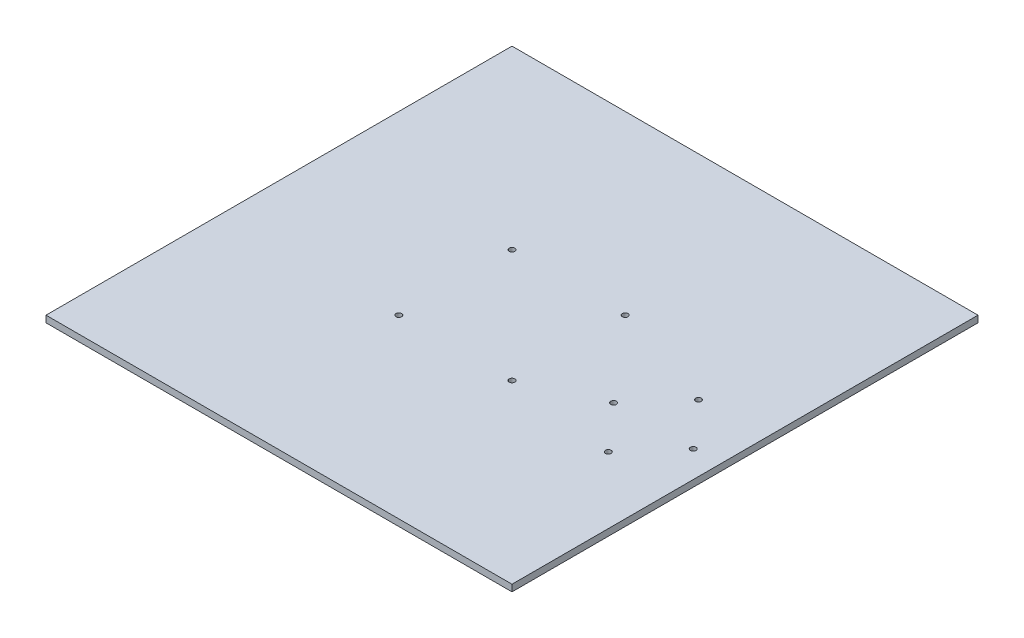
ISO-10303-21;
HEADER;
FILE_DESCRIPTION(('STEP AP214'),'2;1');
FILE_NAME('part.step','',(''),(''),'','','');
FILE_SCHEMA(('AUTOMOTIVE_DESIGN { 1 0 10303 214 1 1 1 1 }'));
ENDSEC;
DATA;
#1=APPLICATION_CONTEXT('core data for automotive mechanical design processes');
#2=APPLICATION_PROTOCOL_DEFINITION('international standard','automotive_design',2000,#1);
#3=PRODUCT_CONTEXT('',#1,'mechanical');
#4=PRODUCT('Part','Part','',(#3));
#5=PRODUCT_RELATED_PRODUCT_CATEGORY('part','',(#4));
#6=PRODUCT_DEFINITION_FORMATION('','',#4);
#7=PRODUCT_DEFINITION_CONTEXT('part definition',#1,'design');
#8=PRODUCT_DEFINITION('design','',#6,#7);
#9=PRODUCT_DEFINITION_SHAPE('','',#8);
#10=(LENGTH_UNIT() NAMED_UNIT(*) SI_UNIT(.MILLI.,.METRE.));
#11=(NAMED_UNIT(*) PLANE_ANGLE_UNIT() SI_UNIT($,.RADIAN.));
#12=(NAMED_UNIT(*) SI_UNIT($,.STERADIAN.) SOLID_ANGLE_UNIT());
#13=UNCERTAINTY_MEASURE_WITH_UNIT(LENGTH_MEASURE(1.E-05),#10,'distance_accuracy_value','');
#14=(GEOMETRIC_REPRESENTATION_CONTEXT(3) GLOBAL_UNCERTAINTY_ASSIGNED_CONTEXT((#13)) GLOBAL_UNIT_ASSIGNED_CONTEXT((#10,
#11,#12)) REPRESENTATION_CONTEXT('',''));
#15=CARTESIAN_POINT('',(0.,0.,0.));
#16=DIRECTION('',(0.,0.,1.));
#17=DIRECTION('',(1.,0.,0.));
#18=AXIS2_PLACEMENT_3D('',#15,#16,#17);
#19=CARTESIAN_POINT('',(-111.125,3.175,111.125));
#20=DIRECTION('',(1.,0.,0.));
#21=DIRECTION('',(0.,0.,-1.));
#22=AXIS2_PLACEMENT_3D('',#19,#20,#21);
#23=PLANE('',#22);
#24=DIRECTION('',(0.,0.,1.));
#25=VECTOR('',#24,1.);
#26=CARTESIAN_POINT('',(-111.125,0.,111.125));
#27=LINE('',#26,#25);
#28=CARTESIAN_POINT('',(-111.125,0.,-111.125));
#29=VERTEX_POINT('',#28);
#30=CARTESIAN_POINT('',(-111.125,0.,111.125));
#31=VERTEX_POINT('',#30);
#32=EDGE_CURVE('E100',#29,#31,#27,.T.);
#33=ORIENTED_EDGE('',*,*,#32,.T.);
#34=DIRECTION('',(0.,-1.,0.));
#35=VECTOR('',#34,1.);
#36=CARTESIAN_POINT('',(-111.125,3.175,111.125));
#37=LINE('',#36,#35);
#38=CARTESIAN_POINT('',(-111.125,3.175,111.125));
#39=VERTEX_POINT('',#38);
#40=EDGE_CURVE('E11',#39,#31,#37,.T.);
#41=ORIENTED_EDGE('',*,*,#40,.F.);
#42=DIRECTION('',(0.,0.,1.));
#43=VECTOR('',#42,1.);
#44=CARTESIAN_POINT('',(-111.125,3.175,111.125));
#45=LINE('',#44,#43);
#46=CARTESIAN_POINT('',(-111.125,3.175,-111.125));
#47=VERTEX_POINT('',#46);
#48=EDGE_CURVE('E88',#47,#39,#45,.T.);
#49=ORIENTED_EDGE('',*,*,#48,.F.);
#50=DIRECTION('',(0.,-1.,0.));
#51=VECTOR('',#50,1.);
#52=CARTESIAN_POINT('',(-111.125,3.175,-111.125));
#53=LINE('',#52,#51);
#54=EDGE_CURVE('E96',#47,#29,#53,.T.);
#55=ORIENTED_EDGE('',*,*,#54,.T.);
#56=EDGE_LOOP('',(#33,#41,#49,#55));
#57=FACE_BOUND('',#56,.T.);
#58=ADVANCED_FACE('F37',(#57),#23,.F.);
#59=CARTESIAN_POINT('',(-111.125,3.175,111.125));
#60=DIRECTION('',(0.,0.,-1.));
#61=DIRECTION('',(-1.,0.,0.));
#62=AXIS2_PLACEMENT_3D('',#59,#60,#61);
#63=PLANE('',#62);
#64=DIRECTION('',(1.,0.,0.));
#65=VECTOR('',#64,1.);
#66=CARTESIAN_POINT('',(-111.125,0.,111.125));
#67=LINE('',#66,#65);
#68=CARTESIAN_POINT('',(111.125,0.,111.125));
#69=VERTEX_POINT('',#68);
#70=EDGE_CURVE('E92',#31,#69,#67,.T.);
#71=ORIENTED_EDGE('',*,*,#70,.T.);
#72=DIRECTION('',(0.,-1.,0.));
#73=VECTOR('',#72,1.);
#74=CARTESIAN_POINT('',(111.125,3.175,111.125));
#75=LINE('',#74,#73);
#76=CARTESIAN_POINT('',(111.125,3.175,111.125));
#77=VERTEX_POINT('',#76);
#78=EDGE_CURVE('E45',#77,#69,#75,.T.);
#79=ORIENTED_EDGE('',*,*,#78,.F.);
#80=DIRECTION('',(1.,0.,0.));
#81=VECTOR('',#80,1.);
#82=CARTESIAN_POINT('',(-111.125,3.175,111.125));
#83=LINE('',#82,#81);
#84=EDGE_CURVE('E83',#39,#77,#83,.T.);
#85=ORIENTED_EDGE('',*,*,#84,.F.);
#86=ORIENTED_EDGE('',*,*,#40,.T.);
#87=EDGE_LOOP('',(#71,#79,#85,#86));
#88=FACE_BOUND('',#87,.T.);
#89=ADVANCED_FACE('F91',(#88),#63,.F.);
#90=CARTESIAN_POINT('',(111.125,3.175,111.125));
#91=DIRECTION('',(-1.,0.,0.));
#92=DIRECTION('',(0.,0.,1.));
#93=AXIS2_PLACEMENT_3D('',#90,#91,#92);
#94=PLANE('',#93);
#95=DIRECTION('',(0.,0.,-1.));
#96=VECTOR('',#95,1.);
#97=CARTESIAN_POINT('',(111.125,0.,111.125));
#98=LINE('',#97,#96);
#99=CARTESIAN_POINT('',(111.125,0.,-111.125));
#100=VERTEX_POINT('',#99);
#101=EDGE_CURVE('E70',#69,#100,#98,.T.);
#102=ORIENTED_EDGE('',*,*,#101,.T.);
#103=DIRECTION('',(0.,-1.,0.));
#104=VECTOR('',#103,1.);
#105=CARTESIAN_POINT('',(111.125,3.175,-111.125));
#106=LINE('',#105,#104);
#107=CARTESIAN_POINT('',(111.125,3.175,-111.125));
#108=VERTEX_POINT('',#107);
#109=EDGE_CURVE('E93',#108,#100,#106,.T.);
#110=ORIENTED_EDGE('',*,*,#109,.F.);
#111=DIRECTION('',(0.,0.,-1.));
#112=VECTOR('',#111,1.);
#113=CARTESIAN_POINT('',(111.125,3.175,111.125));
#114=LINE('',#113,#112);
#115=EDGE_CURVE('E86',#77,#108,#114,.T.);
#116=ORIENTED_EDGE('',*,*,#115,.F.);
#117=ORIENTED_EDGE('',*,*,#78,.T.);
#118=EDGE_LOOP('',(#102,#110,#116,#117));
#119=FACE_BOUND('',#118,.T.);
#120=ADVANCED_FACE('F94',(#119),#94,.F.);
#121=CARTESIAN_POINT('',(-111.125,3.175,-111.125));
#122=DIRECTION('',(0.,0.,1.));
#123=DIRECTION('',(1.,0.,0.));
#124=AXIS2_PLACEMENT_3D('',#121,#122,#123);
#125=PLANE('',#124);
#126=DIRECTION('',(-1.,0.,0.));
#127=VECTOR('',#126,1.);
#128=CARTESIAN_POINT('',(-111.125,0.,-111.125));
#129=LINE('',#128,#127);
#130=EDGE_CURVE('E76',#100,#29,#129,.T.);
#131=ORIENTED_EDGE('',*,*,#130,.T.);
#132=ORIENTED_EDGE('',*,*,#54,.F.);
#133=DIRECTION('',(-1.,0.,0.));
#134=VECTOR('',#133,1.);
#135=CARTESIAN_POINT('',(-111.125,3.175,-111.125));
#136=LINE('',#135,#134);
#137=EDGE_CURVE('E53',#108,#47,#136,.T.);
#138=ORIENTED_EDGE('',*,*,#137,.F.);
#139=ORIENTED_EDGE('',*,*,#109,.T.);
#140=EDGE_LOOP('',(#131,#132,#138,#139));
#141=FACE_BOUND('',#140,.T.);
#142=ADVANCED_FACE('F108',(#141),#125,.F.);
#143=CARTESIAN_POINT('',(0.,3.175,0.));
#144=DIRECTION('',(0.,-1.,0.));
#145=DIRECTION('',(0.,0.,-1.));
#146=AXIS2_PLACEMENT_3D('',#143,#144,#145);
#147=PLANE('',#146);
#148=CARTESIAN_POINT('',(60.425,3.175,12.));
#149=DIRECTION('',(0.,1.,0.));
#150=DIRECTION('',(0.,0.,1.));
#151=AXIS2_PLACEMENT_3D('',#148,#149,#150);
#152=CIRCLE('',#151,1.35254999999999);
#153=CARTESIAN_POINT('',(60.425,3.175,13.35255));
#154=VERTEX_POINT('',#153);
#155=EDGE_CURVE('E158',#154,#154,#152,.T.);
#156=ORIENTED_EDGE('',*,*,#155,.F.);
#157=EDGE_LOOP('',(#156));
#158=FACE_BOUND('',#157,.T.);
#159=CARTESIAN_POINT('',(79.425,3.175,33.5));
#160=DIRECTION('',(0.,1.,0.));
#161=DIRECTION('',(0.,0.,1.));
#162=AXIS2_PLACEMENT_3D('',#159,#160,#161);
#163=CIRCLE('',#162,1.35254999999998);
#164=CARTESIAN_POINT('',(79.425,3.175,34.85255));
#165=VERTEX_POINT('',#164);
#166=EDGE_CURVE('E152',#165,#165,#163,.T.);
#167=ORIENTED_EDGE('',*,*,#166,.F.);
#168=EDGE_LOOP('',(#167));
#169=FACE_BOUND('',#168,.T.);
#170=CARTESIAN_POINT('',(98.425,3.175,12.));
#171=DIRECTION('',(0.,1.,0.));
#172=DIRECTION('',(0.,0.,1.));
#173=AXIS2_PLACEMENT_3D('',#170,#171,#172);
#174=CIRCLE('',#173,1.35254999999999);
#175=CARTESIAN_POINT('',(98.425,3.175,13.35255));
#176=VERTEX_POINT('',#175);
#177=EDGE_CURVE('E146',#176,#176,#174,.T.);
#178=ORIENTED_EDGE('',*,*,#177,.F.);
#179=EDGE_LOOP('',(#178));
#180=FACE_BOUND('',#179,.T.);
#181=CARTESIAN_POINT('',(79.425,3.175,-9.5));
#182=DIRECTION('',(0.,1.,0.));
#183=DIRECTION('',(0.,0.,1.));
#184=AXIS2_PLACEMENT_3D('',#181,#182,#183);
#185=CIRCLE('',#184,1.35254999999998);
#186=CARTESIAN_POINT('',(79.425,3.175,-8.14745000000002));
#187=VERTEX_POINT('',#186);
#188=EDGE_CURVE('E140',#187,#187,#185,.T.);
#189=ORIENTED_EDGE('',*,*,#188,.F.);
#190=EDGE_LOOP('',(#189));
#191=FACE_BOUND('',#190,.T.);
#192=CARTESIAN_POINT('',(-26.9875,3.175,26.9875));
#193=DIRECTION('',(0.,1.,0.));
#194=DIRECTION('',(0.,0.,1.));
#195=AXIS2_PLACEMENT_3D('',#192,#193,#194);
#196=CIRCLE('',#195,1.35255);
#197=CARTESIAN_POINT('',(-26.9875,3.175,28.34005));
#198=VERTEX_POINT('',#197);
#199=EDGE_CURVE('E134',#198,#198,#196,.T.);
#200=ORIENTED_EDGE('',*,*,#199,.F.);
#201=EDGE_LOOP('',(#200));
#202=FACE_BOUND('',#201,.T.);
#203=CARTESIAN_POINT('',(-26.9875,3.175,-26.9875));
#204=DIRECTION('',(0.,1.,0.));
#205=DIRECTION('',(0.,0.,1.));
#206=AXIS2_PLACEMENT_3D('',#203,#204,#205);
#207=CIRCLE('',#206,1.35255);
#208=CARTESIAN_POINT('',(-26.9875,3.175,-25.63495));
#209=VERTEX_POINT('',#208);
#210=EDGE_CURVE('E128',#209,#209,#207,.T.);
#211=ORIENTED_EDGE('',*,*,#210,.F.);
#212=EDGE_LOOP('',(#211));
#213=FACE_BOUND('',#212,.T.);
#214=CARTESIAN_POINT('',(26.9875,3.175,-26.9875));
#215=DIRECTION('',(0.,1.,0.));
#216=DIRECTION('',(0.,0.,1.));
#217=AXIS2_PLACEMENT_3D('',#214,#215,#216);
#218=CIRCLE('',#217,1.35255);
#219=CARTESIAN_POINT('',(26.9875,3.175,-25.63495));
#220=VERTEX_POINT('',#219);
#221=EDGE_CURVE('E122',#220,#220,#218,.T.);
#222=ORIENTED_EDGE('',*,*,#221,.F.);
#223=EDGE_LOOP('',(#222));
#224=FACE_BOUND('',#223,.T.);
#225=CARTESIAN_POINT('',(26.9875,3.175,26.9875));
#226=DIRECTION('',(0.,1.,0.));
#227=DIRECTION('',(0.,0.,1.));
#228=AXIS2_PLACEMENT_3D('',#225,#226,#227);
#229=CIRCLE('',#228,1.35255);
#230=CARTESIAN_POINT('',(26.9875,3.175,28.34005));
#231=VERTEX_POINT('',#230);
#232=EDGE_CURVE('E116',#231,#231,#229,.T.);
#233=ORIENTED_EDGE('',*,*,#232,.F.);
#234=EDGE_LOOP('',(#233));
#235=FACE_BOUND('',#234,.T.);
#236=ORIENTED_EDGE('',*,*,#48,.T.);
#237=ORIENTED_EDGE('',*,*,#84,.T.);
#238=ORIENTED_EDGE('',*,*,#115,.T.);
#239=ORIENTED_EDGE('',*,*,#137,.T.);
#240=EDGE_LOOP('',(#236,#237,#238,#239));
#241=FACE_BOUND('',#240,.T.);
#242=ADVANCED_FACE('F84',(#158,#169,#180,#191,#202,#213,#224,#235,#241),#147,.F.);
#243=CARTESIAN_POINT('',(0.,0.,0.));
#244=DIRECTION('',(0.,-1.,0.));
#245=DIRECTION('',(0.,0.,-1.));
#246=AXIS2_PLACEMENT_3D('',#243,#244,#245);
#247=PLANE('',#246);
#248=CARTESIAN_POINT('',(60.425,0.,12.));
#249=DIRECTION('',(0.,1.,0.));
#250=DIRECTION('',(0.,0.,1.));
#251=AXIS2_PLACEMENT_3D('',#248,#249,#250);
#252=CIRCLE('',#251,1.35254999999999);
#253=CARTESIAN_POINT('',(60.425,0.,13.35255));
#254=VERTEX_POINT('',#253);
#255=EDGE_CURVE('E155',#254,#254,#252,.T.);
#256=ORIENTED_EDGE('',*,*,#255,.T.);
#257=EDGE_LOOP('',(#256));
#258=FACE_BOUND('',#257,.T.);
#259=CARTESIAN_POINT('',(79.425,0.,33.5));
#260=DIRECTION('',(0.,1.,0.));
#261=DIRECTION('',(0.,0.,1.));
#262=AXIS2_PLACEMENT_3D('',#259,#260,#261);
#263=CIRCLE('',#262,1.35254999999999);
#264=CARTESIAN_POINT('',(79.425,0.,34.85255));
#265=VERTEX_POINT('',#264);
#266=EDGE_CURVE('E149',#265,#265,#263,.T.);
#267=ORIENTED_EDGE('',*,*,#266,.T.);
#268=EDGE_LOOP('',(#267));
#269=FACE_BOUND('',#268,.T.);
#270=CARTESIAN_POINT('',(98.425,0.,12.));
#271=DIRECTION('',(0.,1.,0.));
#272=DIRECTION('',(0.,0.,1.));
#273=AXIS2_PLACEMENT_3D('',#270,#271,#272);
#274=CIRCLE('',#273,1.35254999999999);
#275=CARTESIAN_POINT('',(98.425,0.,13.35255));
#276=VERTEX_POINT('',#275);
#277=EDGE_CURVE('E143',#276,#276,#274,.T.);
#278=ORIENTED_EDGE('',*,*,#277,.T.);
#279=EDGE_LOOP('',(#278));
#280=FACE_BOUND('',#279,.T.);
#281=CARTESIAN_POINT('',(79.425,0.,-9.5));
#282=DIRECTION('',(0.,1.,0.));
#283=DIRECTION('',(0.,0.,1.));
#284=AXIS2_PLACEMENT_3D('',#281,#282,#283);
#285=CIRCLE('',#284,1.35254999999999);
#286=CARTESIAN_POINT('',(79.425,0.,-8.14745));
#287=VERTEX_POINT('',#286);
#288=EDGE_CURVE('E137',#287,#287,#285,.T.);
#289=ORIENTED_EDGE('',*,*,#288,.T.);
#290=EDGE_LOOP('',(#289));
#291=FACE_BOUND('',#290,.T.);
#292=CARTESIAN_POINT('',(-26.9875,0.,26.9875));
#293=DIRECTION('',(0.,1.,0.));
#294=DIRECTION('',(0.,0.,1.));
#295=AXIS2_PLACEMENT_3D('',#292,#293,#294);
#296=CIRCLE('',#295,1.35255);
#297=CARTESIAN_POINT('',(-26.9875,0.,28.34005));
#298=VERTEX_POINT('',#297);
#299=EDGE_CURVE('E131',#298,#298,#296,.T.);
#300=ORIENTED_EDGE('',*,*,#299,.T.);
#301=EDGE_LOOP('',(#300));
#302=FACE_BOUND('',#301,.T.);
#303=CARTESIAN_POINT('',(-26.9875,0.,-26.9875));
#304=DIRECTION('',(0.,1.,0.));
#305=DIRECTION('',(0.,0.,1.));
#306=AXIS2_PLACEMENT_3D('',#303,#304,#305);
#307=CIRCLE('',#306,1.35255);
#308=CARTESIAN_POINT('',(-26.9875,0.,-25.63495));
#309=VERTEX_POINT('',#308);
#310=EDGE_CURVE('E125',#309,#309,#307,.T.);
#311=ORIENTED_EDGE('',*,*,#310,.T.);
#312=EDGE_LOOP('',(#311));
#313=FACE_BOUND('',#312,.T.);
#314=CARTESIAN_POINT('',(26.9875,0.,-26.9875));
#315=DIRECTION('',(0.,1.,0.));
#316=DIRECTION('',(0.,0.,1.));
#317=AXIS2_PLACEMENT_3D('',#314,#315,#316);
#318=CIRCLE('',#317,1.35255);
#319=CARTESIAN_POINT('',(26.9875,0.,-25.63495));
#320=VERTEX_POINT('',#319);
#321=EDGE_CURVE('E119',#320,#320,#318,.T.);
#322=ORIENTED_EDGE('',*,*,#321,.T.);
#323=EDGE_LOOP('',(#322));
#324=FACE_BOUND('',#323,.T.);
#325=CARTESIAN_POINT('',(26.9875,0.,26.9875));
#326=DIRECTION('',(0.,1.,0.));
#327=DIRECTION('',(0.,0.,1.));
#328=AXIS2_PLACEMENT_3D('',#325,#326,#327);
#329=CIRCLE('',#328,1.35255);
#330=CARTESIAN_POINT('',(26.9875,0.,28.34005));
#331=VERTEX_POINT('',#330);
#332=EDGE_CURVE('E103',#331,#331,#329,.T.);
#333=ORIENTED_EDGE('',*,*,#332,.T.);
#334=EDGE_LOOP('',(#333));
#335=FACE_BOUND('',#334,.T.);
#336=ORIENTED_EDGE('',*,*,#32,.F.);
#337=ORIENTED_EDGE('',*,*,#130,.F.);
#338=ORIENTED_EDGE('',*,*,#101,.F.);
#339=ORIENTED_EDGE('',*,*,#70,.F.);
#340=EDGE_LOOP('',(#336,#337,#338,#339));
#341=FACE_BOUND('',#340,.T.);
#342=ADVANCED_FACE('F111',(#258,#269,#280,#291,#302,#313,#324,#335,#341),#247,.T.);
#343=CARTESIAN_POINT('',(26.9875,3.175,26.9875));
#344=DIRECTION('',(0.,1.,0.));
#345=DIRECTION('',(0.,0.,1.));
#346=AXIS2_PLACEMENT_3D('',#343,#344,#345);
#347=CYLINDRICAL_SURFACE('',#346,1.35255);
#348=ORIENTED_EDGE('',*,*,#332,.F.);
#349=EDGE_LOOP('',(#348));
#350=FACE_BOUND('',#349,.T.);
#351=ORIENTED_EDGE('',*,*,#232,.T.);
#352=EDGE_LOOP('',(#351));
#353=FACE_BOUND('',#352,.T.);
#354=ADVANCED_FACE('F181',(#350,#353),#347,.F.);
#355=CARTESIAN_POINT('',(26.9875,3.175,-26.9875));
#356=DIRECTION('',(0.,1.,0.));
#357=DIRECTION('',(0.,0.,1.));
#358=AXIS2_PLACEMENT_3D('',#355,#356,#357);
#359=CYLINDRICAL_SURFACE('',#358,1.35255);
#360=ORIENTED_EDGE('',*,*,#321,.F.);
#361=EDGE_LOOP('',(#360));
#362=FACE_BOUND('',#361,.T.);
#363=ORIENTED_EDGE('',*,*,#221,.T.);
#364=EDGE_LOOP('',(#363));
#365=FACE_BOUND('',#364,.T.);
#366=ADVANCED_FACE('F183',(#362,#365),#359,.F.);
#367=CARTESIAN_POINT('',(-26.9875,3.175,-26.9875));
#368=DIRECTION('',(0.,1.,0.));
#369=DIRECTION('',(0.,0.,1.));
#370=AXIS2_PLACEMENT_3D('',#367,#368,#369);
#371=CYLINDRICAL_SURFACE('',#370,1.35255);
#372=ORIENTED_EDGE('',*,*,#310,.F.);
#373=EDGE_LOOP('',(#372));
#374=FACE_BOUND('',#373,.T.);
#375=ORIENTED_EDGE('',*,*,#210,.T.);
#376=EDGE_LOOP('',(#375));
#377=FACE_BOUND('',#376,.T.);
#378=ADVANCED_FACE('F190',(#374,#377),#371,.F.);
#379=CARTESIAN_POINT('',(-26.9875,3.175,26.9875));
#380=DIRECTION('',(0.,1.,0.));
#381=DIRECTION('',(0.,0.,1.));
#382=AXIS2_PLACEMENT_3D('',#379,#380,#381);
#383=CYLINDRICAL_SURFACE('',#382,1.35255);
#384=ORIENTED_EDGE('',*,*,#299,.F.);
#385=EDGE_LOOP('',(#384));
#386=FACE_BOUND('',#385,.T.);
#387=ORIENTED_EDGE('',*,*,#199,.T.);
#388=EDGE_LOOP('',(#387));
#389=FACE_BOUND('',#388,.T.);
#390=ADVANCED_FACE('F233',(#386,#389),#383,.F.);
#391=CARTESIAN_POINT('',(79.425,3.175,-9.5));
#392=DIRECTION('',(0.,1.,0.));
#393=DIRECTION('',(0.,0.,1.));
#394=AXIS2_PLACEMENT_3D('',#391,#392,#393);
#395=CYLINDRICAL_SURFACE('',#394,1.35254999999999);
#396=ORIENTED_EDGE('',*,*,#288,.F.);
#397=EDGE_LOOP('',(#396));
#398=FACE_BOUND('',#397,.T.);
#399=ORIENTED_EDGE('',*,*,#188,.T.);
#400=EDGE_LOOP('',(#399));
#401=FACE_BOUND('',#400,.T.);
#402=ADVANCED_FACE('F226',(#398,#401),#395,.F.);
#403=CARTESIAN_POINT('',(98.425,3.175,12.));
#404=DIRECTION('',(0.,1.,0.));
#405=DIRECTION('',(0.,0.,1.));
#406=AXIS2_PLACEMENT_3D('',#403,#404,#405);
#407=CYLINDRICAL_SURFACE('',#406,1.35254999999999);
#408=ORIENTED_EDGE('',*,*,#277,.F.);
#409=EDGE_LOOP('',(#408));
#410=FACE_BOUND('',#409,.T.);
#411=ORIENTED_EDGE('',*,*,#177,.T.);
#412=EDGE_LOOP('',(#411));
#413=FACE_BOUND('',#412,.T.);
#414=ADVANCED_FACE('F232',(#410,#413),#407,.F.);
#415=CARTESIAN_POINT('',(79.425,3.175,33.5));
#416=DIRECTION('',(0.,1.,0.));
#417=DIRECTION('',(0.,0.,1.));
#418=AXIS2_PLACEMENT_3D('',#415,#416,#417);
#419=CYLINDRICAL_SURFACE('',#418,1.35254999999999);
#420=ORIENTED_EDGE('',*,*,#266,.F.);
#421=EDGE_LOOP('',(#420));
#422=FACE_BOUND('',#421,.T.);
#423=ORIENTED_EDGE('',*,*,#166,.T.);
#424=EDGE_LOOP('',(#423));
#425=FACE_BOUND('',#424,.T.);
#426=ADVANCED_FACE('F245',(#422,#425),#419,.F.);
#427=CARTESIAN_POINT('',(60.425,3.175,12.));
#428=DIRECTION('',(0.,1.,0.));
#429=DIRECTION('',(0.,0.,1.));
#430=AXIS2_PLACEMENT_3D('',#427,#428,#429);
#431=CYLINDRICAL_SURFACE('',#430,1.35254999999999);
#432=ORIENTED_EDGE('',*,*,#255,.F.);
#433=EDGE_LOOP('',(#432));
#434=FACE_BOUND('',#433,.T.);
#435=ORIENTED_EDGE('',*,*,#155,.T.);
#436=EDGE_LOOP('',(#435));
#437=FACE_BOUND('',#436,.T.);
#438=ADVANCED_FACE('F162',(#434,#437),#431,.F.);
#439=CLOSED_SHELL('',(#58,#89,#120,#142,#242,#342,#354,#366,#378,#390,#402,#414,#426,#438));
#440=MANIFOLD_SOLID_BREP('B2',#439);
#441=ADVANCED_BREP_SHAPE_REPRESENTATION('',(#18,#440),#14);
#442=SHAPE_DEFINITION_REPRESENTATION(#9,#441);
ENDSEC;
END-ISO-10303-21;
